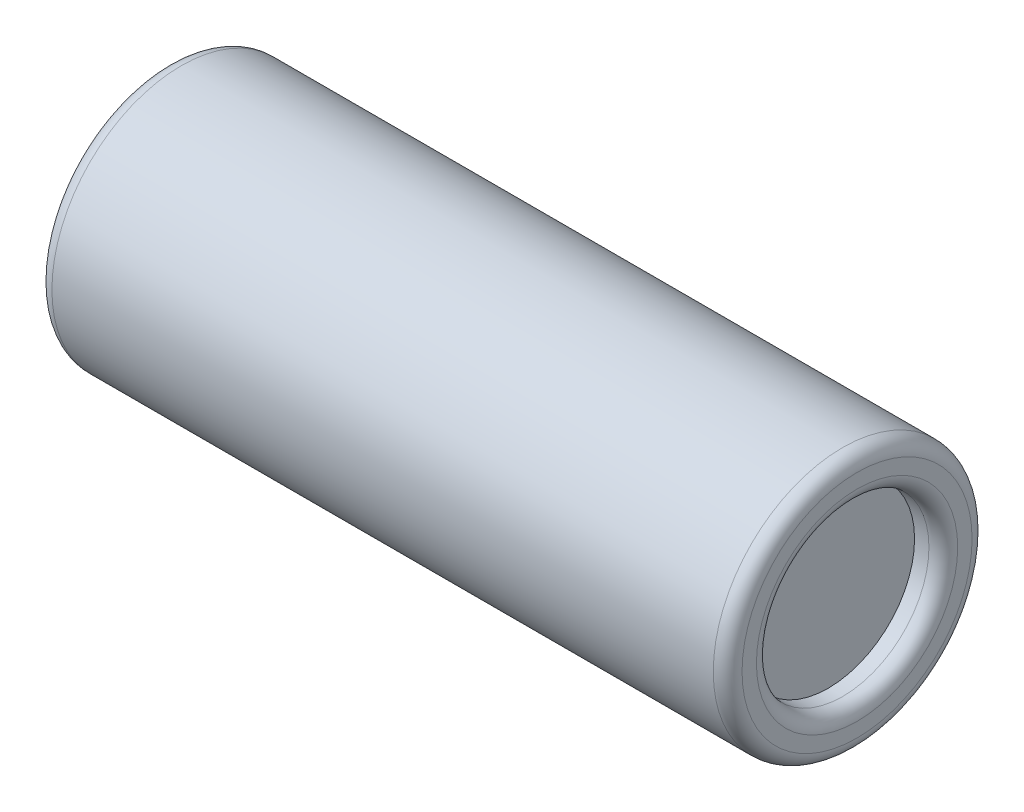
ISO-10303-21;
HEADER;
FILE_DESCRIPTION(('STEP AP214'),'2;1');
FILE_NAME('part.step','',(''),(''),'','','');
FILE_SCHEMA(('AUTOMOTIVE_DESIGN { 1 0 10303 214 1 1 1 1 }'));
ENDSEC;
DATA;
#1=APPLICATION_CONTEXT('core data for automotive mechanical design processes');
#2=APPLICATION_PROTOCOL_DEFINITION('international standard','automotive_design',2000,#1);
#3=PRODUCT_CONTEXT('',#1,'mechanical');
#4=PRODUCT('Part','Part','',(#3));
#5=PRODUCT_RELATED_PRODUCT_CATEGORY('part','',(#4));
#6=PRODUCT_DEFINITION_FORMATION('','',#4);
#7=PRODUCT_DEFINITION_CONTEXT('part definition',#1,'design');
#8=PRODUCT_DEFINITION('design','',#6,#7);
#9=PRODUCT_DEFINITION_SHAPE('','',#8);
#10=(LENGTH_UNIT() NAMED_UNIT(*) SI_UNIT(.MILLI.,.METRE.));
#11=(NAMED_UNIT(*) PLANE_ANGLE_UNIT() SI_UNIT($,.RADIAN.));
#12=(NAMED_UNIT(*) SI_UNIT($,.STERADIAN.) SOLID_ANGLE_UNIT());
#13=UNCERTAINTY_MEASURE_WITH_UNIT(LENGTH_MEASURE(1.E-05),#10,'distance_accuracy_value','');
#14=(GEOMETRIC_REPRESENTATION_CONTEXT(3) GLOBAL_UNCERTAINTY_ASSIGNED_CONTEXT((#13)) GLOBAL_UNIT_ASSIGNED_CONTEXT((#10,
#11,#12)) REPRESENTATION_CONTEXT('',''));
#15=CARTESIAN_POINT('',(0.,0.,0.));
#16=DIRECTION('',(0.,0.,1.));
#17=DIRECTION('',(1.,0.,0.));
#18=AXIS2_PLACEMENT_3D('',#15,#16,#17);
#19=CARTESIAN_POINT('',(24.,0.,0.));
#20=DIRECTION('',(-1.,0.,0.));
#21=DIRECTION('',(0.,0.,1.));
#22=AXIS2_PLACEMENT_3D('',#19,#20,#21);
#23=CYLINDRICAL_SURFACE('',#22,4.5);
#24=CARTESIAN_POINT('',(23.5,0.,0.));
#25=DIRECTION('',(1.,0.,0.));
#26=DIRECTION('',(0.,0.,-1.));
#27=AXIS2_PLACEMENT_3D('',#24,#25,#26);
#28=CIRCLE('',#27,4.5);
#29=CARTESIAN_POINT('',(23.5,0.,-4.5));
#30=VERTEX_POINT('',#29);
#31=EDGE_CURVE('E10',#30,#30,#28,.F.);
#32=ORIENTED_EDGE('',*,*,#31,.T.);
#33=EDGE_LOOP('',(#32));
#34=FACE_BOUND('',#33,.T.);
#35=CARTESIAN_POINT('',(0.5,0.,0.));
#36=DIRECTION('',(1.,0.,0.));
#37=DIRECTION('',(0.,0.,-1.));
#38=AXIS2_PLACEMENT_3D('',#35,#36,#37);
#39=CIRCLE('',#38,4.5);
#40=CARTESIAN_POINT('',(0.5,0.,-4.5));
#41=VERTEX_POINT('',#40);
#42=EDGE_CURVE('E56',#41,#41,#39,.T.);
#43=ORIENTED_EDGE('',*,*,#42,.T.);
#44=EDGE_LOOP('',(#43));
#45=FACE_BOUND('',#44,.T.);
#46=ADVANCED_FACE('F33',(#34,#45),#23,.T.);
#47=CARTESIAN_POINT('',(24.,0.,0.));
#48=DIRECTION('',(1.,0.,0.));
#49=DIRECTION('',(0.,0.,-1.));
#50=AXIS2_PLACEMENT_3D('',#47,#48,#49);
#51=PLANE('',#50);
#52=CARTESIAN_POINT('',(24.,0.,0.));
#53=DIRECTION('',(1.,0.,0.));
#54=DIRECTION('',(0.,0.,-1.));
#55=AXIS2_PLACEMENT_3D('',#52,#53,#54);
#56=CIRCLE('',#55,3.5);
#57=CARTESIAN_POINT('',(24.,0.,-3.5));
#58=VERTEX_POINT('',#57);
#59=EDGE_CURVE('E40',#58,#58,#56,.F.);
#60=ORIENTED_EDGE('',*,*,#59,.T.);
#61=EDGE_LOOP('',(#60));
#62=FACE_BOUND('',#61,.T.);
#63=CARTESIAN_POINT('',(24.,0.,0.));
#64=DIRECTION('',(1.,0.,0.));
#65=DIRECTION('',(0.,0.,-1.));
#66=AXIS2_PLACEMENT_3D('',#63,#64,#65);
#67=CIRCLE('',#66,4.);
#68=CARTESIAN_POINT('',(24.,0.,-4.));
#69=VERTEX_POINT('',#68);
#70=EDGE_CURVE('E44',#69,#69,#67,.T.);
#71=ORIENTED_EDGE('',*,*,#70,.T.);
#72=EDGE_LOOP('',(#71));
#73=FACE_BOUND('',#72,.T.);
#74=ADVANCED_FACE('F81',(#62,#73),#51,.T.);
#75=CARTESIAN_POINT('',(0.,0.,0.));
#76=DIRECTION('',(1.,0.,0.));
#77=DIRECTION('',(0.,0.,-1.));
#78=AXIS2_PLACEMENT_3D('',#75,#76,#77);
#79=PLANE('',#78);
#80=CARTESIAN_POINT('',(0.,0.,0.));
#81=DIRECTION('',(1.,0.,0.));
#82=DIRECTION('',(0.,0.,-1.));
#83=AXIS2_PLACEMENT_3D('',#80,#81,#82);
#84=CIRCLE('',#83,4.);
#85=CARTESIAN_POINT('',(0.,0.,-4.));
#86=VERTEX_POINT('',#85);
#87=EDGE_CURVE('E53',#86,#86,#84,.F.);
#88=ORIENTED_EDGE('',*,*,#87,.T.);
#89=EDGE_LOOP('',(#88));
#90=FACE_BOUND('',#89,.T.);
#91=ADVANCED_FACE('F76',(#90),#79,.F.);
#92=CARTESIAN_POINT('',(0.5,0.,0.));
#93=DIRECTION('',(1.,0.,0.));
#94=DIRECTION('',(0.,0.,-1.));
#95=AXIS2_PLACEMENT_3D('',#92,#93,#94);
#96=TOROIDAL_SURFACE('',#95,4.,0.5);
#97=ORIENTED_EDGE('',*,*,#87,.F.);
#98=EDGE_LOOP('',(#97));
#99=FACE_BOUND('',#98,.T.);
#100=ORIENTED_EDGE('',*,*,#42,.F.);
#101=EDGE_LOOP('',(#100));
#102=FACE_BOUND('',#101,.T.);
#103=ADVANCED_FACE('F67',(#99,#102),#96,.T.);
#104=CARTESIAN_POINT('',(23.,0.,0.));
#105=DIRECTION('',(1.,0.,0.));
#106=DIRECTION('',(0.,0.,-1.));
#107=AXIS2_PLACEMENT_3D('',#104,#105,#106);
#108=CYLINDRICAL_SURFACE('',#107,3.);
#109=CARTESIAN_POINT('',(23.5,0.,0.));
#110=DIRECTION('',(1.,0.,0.));
#111=DIRECTION('',(0.,0.,-1.));
#112=AXIS2_PLACEMENT_3D('',#109,#110,#111);
#113=CIRCLE('',#112,3.);
#114=CARTESIAN_POINT('',(23.5,0.,-3.));
#115=VERTEX_POINT('',#114);
#116=EDGE_CURVE('E48',#115,#115,#113,.T.);
#117=ORIENTED_EDGE('',*,*,#116,.T.);
#118=EDGE_LOOP('',(#117));
#119=FACE_BOUND('',#118,.T.);
#120=CARTESIAN_POINT('',(23.,0.,0.));
#121=DIRECTION('',(1.,0.,0.));
#122=DIRECTION('',(0.,0.,-1.));
#123=AXIS2_PLACEMENT_3D('',#120,#121,#122);
#124=CIRCLE('',#123,3.);
#125=CARTESIAN_POINT('',(23.,0.,-3.));
#126=VERTEX_POINT('',#125);
#127=EDGE_CURVE('E59',#126,#126,#124,.T.);
#128=ORIENTED_EDGE('',*,*,#127,.F.);
#129=EDGE_LOOP('',(#128));
#130=FACE_BOUND('',#129,.T.);
#131=ADVANCED_FACE('F65',(#119,#130),#108,.F.);
#132=CARTESIAN_POINT('',(23.,0.,0.));
#133=DIRECTION('',(1.,0.,0.));
#134=DIRECTION('',(0.,0.,-1.));
#135=AXIS2_PLACEMENT_3D('',#132,#133,#134);
#136=PLANE('',#135);
#137=ORIENTED_EDGE('',*,*,#127,.T.);
#138=EDGE_LOOP('',(#137));
#139=FACE_BOUND('',#138,.T.);
#140=ADVANCED_FACE('F63',(#139),#136,.T.);
#141=CARTESIAN_POINT('',(23.5,0.,0.));
#142=DIRECTION('',(1.,0.,0.));
#143=DIRECTION('',(0.,0.,-1.));
#144=AXIS2_PLACEMENT_3D('',#141,#142,#143);
#145=TOROIDAL_SURFACE('',#144,3.5,0.5);
#146=ORIENTED_EDGE('',*,*,#59,.F.);
#147=EDGE_LOOP('',(#146));
#148=FACE_BOUND('',#147,.T.);
#149=ORIENTED_EDGE('',*,*,#116,.F.);
#150=EDGE_LOOP('',(#149));
#151=FACE_BOUND('',#150,.T.);
#152=ADVANCED_FACE('F74',(#148,#151),#145,.T.);
#153=CARTESIAN_POINT('',(23.5,0.,0.));
#154=DIRECTION('',(1.,0.,0.));
#155=DIRECTION('',(0.,0.,-1.));
#156=AXIS2_PLACEMENT_3D('',#153,#154,#155);
#157=TOROIDAL_SURFACE('',#156,4.,0.5);
#158=ORIENTED_EDGE('',*,*,#31,.F.);
#159=EDGE_LOOP('',(#158));
#160=FACE_BOUND('',#159,.T.);
#161=ORIENTED_EDGE('',*,*,#70,.F.);
#162=EDGE_LOOP('',(#161));
#163=FACE_BOUND('',#162,.T.);
#164=ADVANCED_FACE('F35',(#160,#163),#157,.T.);
#165=CLOSED_SHELL('',(#46,#74,#91,#103,#131,#140,#152,#164));
#166=MANIFOLD_SOLID_BREP('B2',#165);
#167=ADVANCED_BREP_SHAPE_REPRESENTATION('',(#18,#166),#14);
#168=SHAPE_DEFINITION_REPRESENTATION(#9,#167);
ENDSEC;
END-ISO-10303-21;
